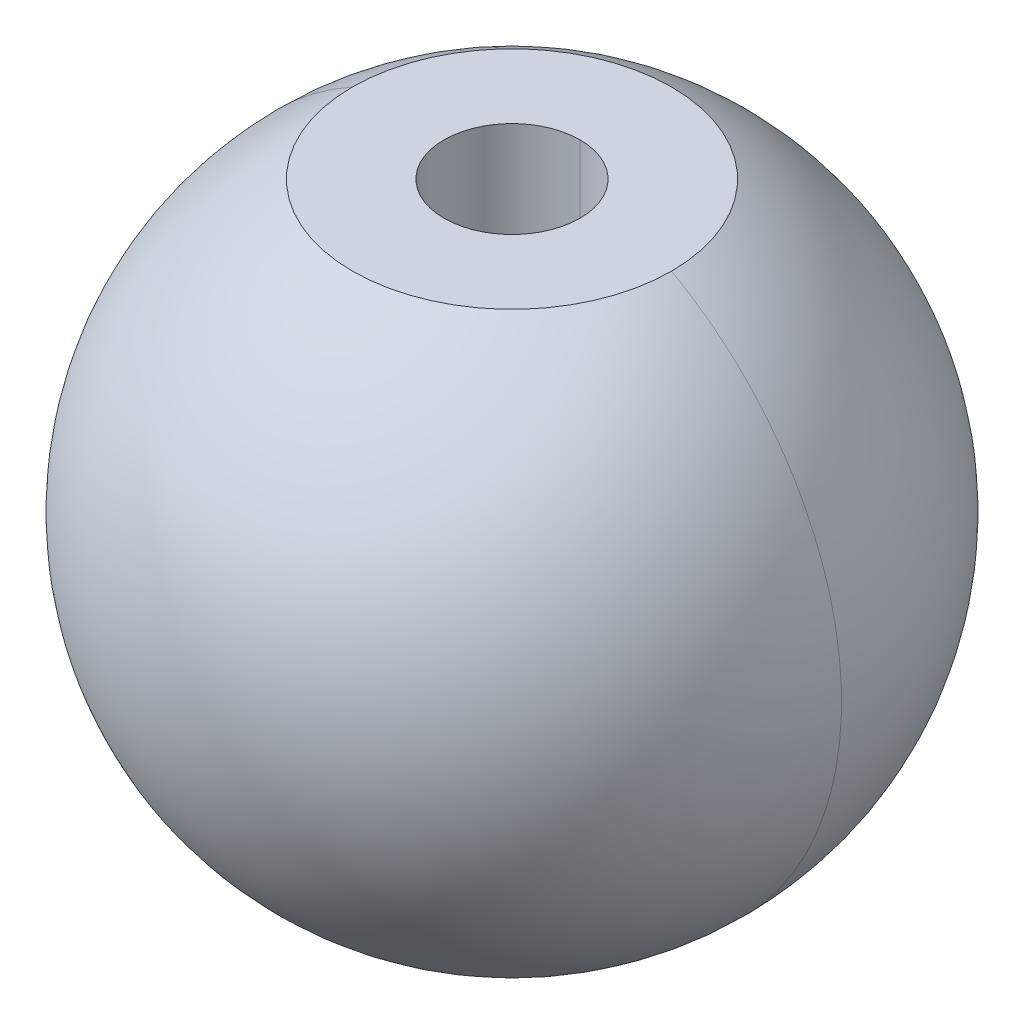
ISO-10303-21;
HEADER;
FILE_DESCRIPTION(('STEP AP214'),'2;1');
FILE_NAME('part.step','',(''),(''),'','','');
FILE_SCHEMA(('AUTOMOTIVE_DESIGN { 1 0 10303 214 1 1 1 1 }'));
ENDSEC;
DATA;
#1=APPLICATION_CONTEXT('core data for automotive mechanical design processes');
#2=APPLICATION_PROTOCOL_DEFINITION('international standard','automotive_design',2000,#1);
#3=PRODUCT_CONTEXT('',#1,'mechanical');
#4=PRODUCT('Part','Part','',(#3));
#5=PRODUCT_RELATED_PRODUCT_CATEGORY('part','',(#4));
#6=PRODUCT_DEFINITION_FORMATION('','',#4);
#7=PRODUCT_DEFINITION_CONTEXT('part definition',#1,'design');
#8=PRODUCT_DEFINITION('design','',#6,#7);
#9=PRODUCT_DEFINITION_SHAPE('','',#8);
#10=(LENGTH_UNIT() NAMED_UNIT(*) SI_UNIT(.MILLI.,.METRE.));
#11=(NAMED_UNIT(*) PLANE_ANGLE_UNIT() SI_UNIT($,.RADIAN.));
#12=(NAMED_UNIT(*) SI_UNIT($,.STERADIAN.) SOLID_ANGLE_UNIT());
#13=UNCERTAINTY_MEASURE_WITH_UNIT(LENGTH_MEASURE(1.E-05),#10,'distance_accuracy_value','');
#14=(GEOMETRIC_REPRESENTATION_CONTEXT(3) GLOBAL_UNCERTAINTY_ASSIGNED_CONTEXT((#13)) GLOBAL_UNIT_ASSIGNED_CONTEXT((#10,
#11,#12)) REPRESENTATION_CONTEXT('',''));
#15=CARTESIAN_POINT('',(0.,0.,0.));
#16=DIRECTION('',(0.,0.,1.));
#17=DIRECTION('',(1.,0.,0.));
#18=AXIS2_PLACEMENT_3D('',#15,#16,#17);
#19=CARTESIAN_POINT('',(0.,7.,0.));
#20=DIRECTION('',(0.,1.,0.));
#21=DIRECTION('',(0.,0.,1.));
#22=AXIS2_PLACEMENT_3D('',#19,#20,#21);
#23=CYLINDRICAL_SURFACE('',#22,1.65);
#24=CARTESIAN_POINT('',(0.,0.,0.));
#25=DIRECTION('',(0.,1.,0.));
#26=DIRECTION('',(0.,0.,1.));
#27=AXIS2_PLACEMENT_3D('',#24,#25,#26);
#28=CIRCLE('',#27,1.65);
#29=CARTESIAN_POINT('',(0.,0.,-1.65));
#30=VERTEX_POINT('',#29);
#31=CARTESIAN_POINT('',(0.,0.,1.65));
#32=VERTEX_POINT('',#31);
#33=EDGE_CURVE('E20',#30,#32,#28,.T.);
#34=ORIENTED_EDGE('',*,*,#33,.F.);
#35=DIRECTION('',(0.,1.,0.));
#36=VECTOR('',#35,1.);
#37=CARTESIAN_POINT('',(0.,7.,-1.65));
#38=LINE('',#37,#36);
#39=CARTESIAN_POINT('',(0.,7.,-1.65));
#40=VERTEX_POINT('',#39);
#41=EDGE_CURVE('E11',#30,#40,#38,.T.);
#42=ORIENTED_EDGE('',*,*,#41,.T.);
#43=CARTESIAN_POINT('',(0.,7.,0.));
#44=DIRECTION('',(0.,1.,0.));
#45=DIRECTION('',(0.,0.,1.));
#46=AXIS2_PLACEMENT_3D('',#43,#44,#45);
#47=CIRCLE('',#46,1.65);
#48=CARTESIAN_POINT('',(0.,7.,1.65));
#49=VERTEX_POINT('',#48);
#50=EDGE_CURVE('E27',#40,#49,#47,.T.);
#51=ORIENTED_EDGE('',*,*,#50,.T.);
#52=DIRECTION('',(0.,1.,0.));
#53=VECTOR('',#52,1.);
#54=CARTESIAN_POINT('',(0.,7.,1.65));
#55=LINE('',#54,#53);
#56=EDGE_CURVE('E94',#32,#49,#55,.T.);
#57=ORIENTED_EDGE('',*,*,#56,.F.);
#58=EDGE_LOOP('',(#34,#42,#51,#57));
#59=FACE_BOUND('',#58,.T.);
#60=ADVANCED_FACE('F16',(#59),#23,.F.);
#61=CARTESIAN_POINT('',(0.,0.,0.));
#62=DIRECTION('',(0.,1.,0.));
#63=DIRECTION('',(0.,0.,1.));
#64=AXIS2_PLACEMENT_3D('',#61,#62,#63);
#65=CONICAL_SURFACE('',#64,1.65,1.02974425867665);
#66=DIRECTION('',(0.,0.515038074910055,0.857167300702112));
#67=VECTOR('',#66,1.);
#68=CARTESIAN_POINT('',(0.,0.,1.65));
#69=LINE('',#68,#67);
#70=CARTESIAN_POINT('',(0.,-0.991420021395474,0.));
#71=VERTEX_POINT('',#70);
#72=EDGE_CURVE('E85',#71,#32,#69,.T.);
#73=ORIENTED_EDGE('',*,*,#72,.F.);
#74=DIRECTION('',(0.,0.515038074910055,-0.857167300702112));
#75=VECTOR('',#74,1.);
#76=CARTESIAN_POINT('',(0.,0.,-1.65));
#77=LINE('',#76,#75);
#78=EDGE_CURVE('E102',#71,#30,#77,.T.);
#79=ORIENTED_EDGE('',*,*,#78,.T.);
#80=ORIENTED_EDGE('',*,*,#33,.T.);
#81=EDGE_LOOP('',(#73,#79,#80));
#82=FACE_BOUND('',#81,.T.);
#83=ADVANCED_FACE('F119',(#82),#65,.F.);
#84=CARTESIAN_POINT('',(0.,0.,0.));
#85=DIRECTION('',(0.,0.,1.));
#86=DIRECTION('',(-1.,0.,0.));
#87=AXIS2_PLACEMENT_3D('',#84,#85,#86);
#88=SPHERICAL_SURFACE('',#87,8.);
#89=CARTESIAN_POINT('',(0.,0.,0.));
#90=DIRECTION('',(0.,0.,-1.));
#91=DIRECTION('',(-1.,0.,0.));
#92=AXIS2_PLACEMENT_3D('',#89,#90,#91);
#93=CIRCLE('',#92,8.);
#94=CARTESIAN_POINT('',(0.,-8.,0.));
#95=VERTEX_POINT('',#94);
#96=CARTESIAN_POINT('',(-3.87298334620742,7.,0.));
#97=VERTEX_POINT('',#96);
#98=EDGE_CURVE('E70',#95,#97,#93,.T.);
#99=ORIENTED_EDGE('',*,*,#98,.F.);
#100=CARTESIAN_POINT('',(0.,0.,0.));
#101=DIRECTION('',(0.,0.,1.));
#102=DIRECTION('',(1.,0.,0.));
#103=AXIS2_PLACEMENT_3D('',#100,#101,#102);
#104=CIRCLE('',#103,8.);
#105=CARTESIAN_POINT('',(3.87298334620742,7.,0.));
#106=VERTEX_POINT('',#105);
#107=EDGE_CURVE('E72',#95,#106,#104,.T.);
#108=ORIENTED_EDGE('',*,*,#107,.T.);
#109=CARTESIAN_POINT('',(0.,7.,0.));
#110=DIRECTION('',(0.,1.,0.));
#111=DIRECTION('',(0.,0.,1.));
#112=AXIS2_PLACEMENT_3D('',#109,#110,#111);
#113=CIRCLE('',#112,3.87298334620742);
#114=EDGE_CURVE('E67',#97,#106,#113,.T.);
#115=ORIENTED_EDGE('',*,*,#114,.F.);
#116=EDGE_LOOP('',(#99,#108,#115));
#117=FACE_BOUND('',#116,.T.);
#118=ADVANCED_FACE('F69',(#117),#88,.T.);
#119=CARTESIAN_POINT('',(0.,0.,0.));
#120=DIRECTION('',(0.,0.,1.));
#121=DIRECTION('',(-1.,0.,0.));
#122=AXIS2_PLACEMENT_3D('',#119,#120,#121);
#123=SPHERICAL_SURFACE('',#122,8.);
#124=ORIENTED_EDGE('',*,*,#107,.F.);
#125=ORIENTED_EDGE('',*,*,#98,.T.);
#126=CARTESIAN_POINT('',(0.,7.,0.));
#127=DIRECTION('',(0.,1.,0.));
#128=DIRECTION('',(0.,0.,1.));
#129=AXIS2_PLACEMENT_3D('',#126,#127,#128);
#130=CIRCLE('',#129,3.87298334620742);
#131=EDGE_CURVE('E77',#106,#97,#130,.T.);
#132=ORIENTED_EDGE('',*,*,#131,.F.);
#133=EDGE_LOOP('',(#124,#125,#132));
#134=FACE_BOUND('',#133,.T.);
#135=ADVANCED_FACE('F18',(#134),#123,.T.);
#136=CARTESIAN_POINT('',(-3.87298334620742,7.,0.));
#137=DIRECTION('',(0.,1.,0.));
#138=DIRECTION('',(1.,0.,0.));
#139=AXIS2_PLACEMENT_3D('',#136,#137,#138);
#140=PLANE('',#139);
#141=ORIENTED_EDGE('',*,*,#114,.T.);
#142=ORIENTED_EDGE('',*,*,#131,.T.);
#143=EDGE_LOOP('',(#141,#142));
#144=FACE_BOUND('',#143,.T.);
#145=CARTESIAN_POINT('',(0.,7.,0.));
#146=DIRECTION('',(0.,1.,0.));
#147=DIRECTION('',(0.,0.,1.));
#148=AXIS2_PLACEMENT_3D('',#145,#146,#147);
#149=CIRCLE('',#148,1.65);
#150=EDGE_CURVE('E96',#49,#40,#149,.T.);
#151=ORIENTED_EDGE('',*,*,#150,.F.);
#152=ORIENTED_EDGE('',*,*,#50,.F.);
#153=EDGE_LOOP('',(#151,#152));
#154=FACE_BOUND('',#153,.T.);
#155=ADVANCED_FACE('F82',(#144,#154),#140,.T.);
#156=CARTESIAN_POINT('',(0.,0.,0.));
#157=DIRECTION('',(0.,1.,0.));
#158=DIRECTION('',(0.,0.,1.));
#159=AXIS2_PLACEMENT_3D('',#156,#157,#158);
#160=CONICAL_SURFACE('',#159,1.65,1.02974425867665);
#161=ORIENTED_EDGE('',*,*,#78,.F.);
#162=ORIENTED_EDGE('',*,*,#72,.T.);
#163=CARTESIAN_POINT('',(0.,0.,0.));
#164=DIRECTION('',(0.,1.,0.));
#165=DIRECTION('',(0.,0.,1.));
#166=AXIS2_PLACEMENT_3D('',#163,#164,#165);
#167=CIRCLE('',#166,1.65);
#168=EDGE_CURVE('E91',#32,#30,#167,.T.);
#169=ORIENTED_EDGE('',*,*,#168,.T.);
#170=EDGE_LOOP('',(#161,#162,#169));
#171=FACE_BOUND('',#170,.T.);
#172=ADVANCED_FACE('F132',(#171),#160,.F.);
#173=CARTESIAN_POINT('',(0.,7.,0.));
#174=DIRECTION('',(0.,1.,0.));
#175=DIRECTION('',(0.,0.,1.));
#176=AXIS2_PLACEMENT_3D('',#173,#174,#175);
#177=CYLINDRICAL_SURFACE('',#176,1.65);
#178=ORIENTED_EDGE('',*,*,#41,.F.);
#179=ORIENTED_EDGE('',*,*,#168,.F.);
#180=ORIENTED_EDGE('',*,*,#56,.T.);
#181=ORIENTED_EDGE('',*,*,#150,.T.);
#182=EDGE_LOOP('',(#178,#179,#180,#181));
#183=FACE_BOUND('',#182,.T.);
#184=ADVANCED_FACE('F116',(#183),#177,.F.);
#185=CLOSED_SHELL('',(#60,#83,#118,#135,#155,#172,#184));
#186=MANIFOLD_SOLID_BREP('B1',#185);
#187=ADVANCED_BREP_SHAPE_REPRESENTATION('',(#18,#186),#14);
#188=SHAPE_DEFINITION_REPRESENTATION(#9,#187);
ENDSEC;
END-ISO-10303-21;
